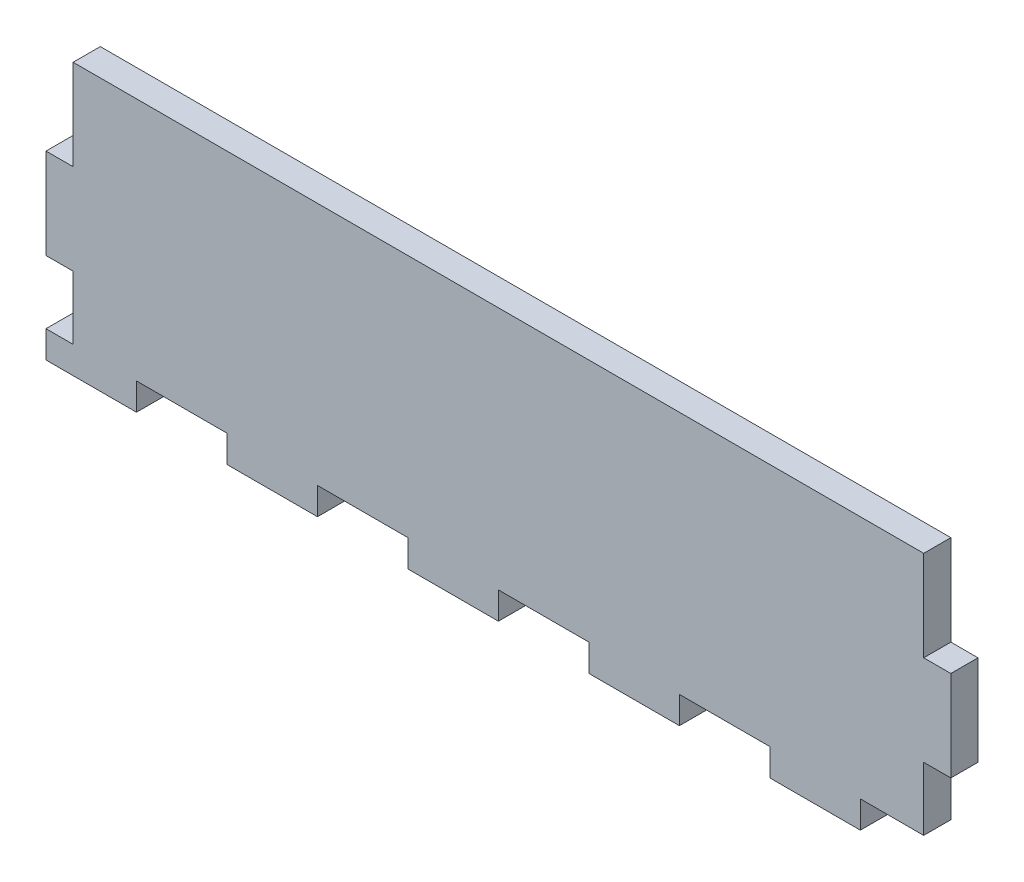
ISO-10303-21;
HEADER;
FILE_DESCRIPTION(('STEP AP214'),'2;1');
FILE_NAME('part.step','',(''),(''),'','','');
FILE_SCHEMA(('AUTOMOTIVE_DESIGN { 1 0 10303 214 1 1 1 1 }'));
ENDSEC;
DATA;
#1=APPLICATION_CONTEXT('core data for automotive mechanical design processes');
#2=APPLICATION_PROTOCOL_DEFINITION('international standard','automotive_design',2000,#1);
#3=PRODUCT_CONTEXT('',#1,'mechanical');
#4=PRODUCT('Part','Part','',(#3));
#5=PRODUCT_RELATED_PRODUCT_CATEGORY('part','',(#4));
#6=PRODUCT_DEFINITION_FORMATION('','',#4);
#7=PRODUCT_DEFINITION_CONTEXT('part definition',#1,'design');
#8=PRODUCT_DEFINITION('design','',#6,#7);
#9=PRODUCT_DEFINITION_SHAPE('','',#8);
#10=(LENGTH_UNIT() NAMED_UNIT(*) SI_UNIT(.MILLI.,.METRE.));
#11=(NAMED_UNIT(*) PLANE_ANGLE_UNIT() SI_UNIT($,.RADIAN.));
#12=(NAMED_UNIT(*) SI_UNIT($,.STERADIAN.) SOLID_ANGLE_UNIT());
#13=UNCERTAINTY_MEASURE_WITH_UNIT(LENGTH_MEASURE(1.E-05),#10,'distance_accuracy_value','');
#14=(GEOMETRIC_REPRESENTATION_CONTEXT(3) GLOBAL_UNCERTAINTY_ASSIGNED_CONTEXT((#13)) GLOBAL_UNIT_ASSIGNED_CONTEXT((#10,
#11,#12)) REPRESENTATION_CONTEXT('',''));
#15=CARTESIAN_POINT('',(0.,0.,0.));
#16=DIRECTION('',(0.,0.,1.));
#17=DIRECTION('',(1.,0.,0.));
#18=AXIS2_PLACEMENT_3D('',#15,#16,#17);
#19=CARTESIAN_POINT('',(-220.231213872832,146.098265895954,6.));
#20=DIRECTION('',(1.,0.,0.));
#21=DIRECTION('',(0.,0.,-1.));
#22=AXIS2_PLACEMENT_3D('',#19,#20,#21);
#23=PLANE('',#22);
#24=DIRECTION('',(0.,-1.,0.));
#25=VECTOR('',#24,1.);
#26=CARTESIAN_POINT('',(-220.231213872832,146.098265895954,0.));
#27=LINE('',#26,#25);
#28=CARTESIAN_POINT('',(-220.231213872832,126.098265895954,0.));
#29=VERTEX_POINT('',#28);
#30=CARTESIAN_POINT('',(-220.231213872832,106.098265895954,0.));
#31=VERTEX_POINT('',#30);
#32=EDGE_CURVE('E296',#29,#31,#27,.T.);
#33=ORIENTED_EDGE('',*,*,#32,.T.);
#34=DIRECTION('',(0.,0.,-1.));
#35=VECTOR('',#34,1.);
#36=CARTESIAN_POINT('',(-220.231213872832,106.098265895954,10.));
#37=LINE('',#36,#35);
#38=CARTESIAN_POINT('',(-220.231213872832,106.098265895954,6.));
#39=VERTEX_POINT('',#38);
#40=EDGE_CURVE('E543',#39,#31,#37,.T.);
#41=ORIENTED_EDGE('',*,*,#40,.F.);
#42=DIRECTION('',(0.,-1.,0.));
#43=VECTOR('',#42,1.);
#44=CARTESIAN_POINT('',(-220.231213872832,146.098265895954,6.));
#45=LINE('',#44,#43);
#46=CARTESIAN_POINT('',(-220.231213872832,126.098265895954,6.));
#47=VERTEX_POINT('',#46);
#48=EDGE_CURVE('E283',#47,#39,#45,.T.);
#49=ORIENTED_EDGE('',*,*,#48,.F.);
#50=DIRECTION('',(0.,0.,-1.));
#51=VECTOR('',#50,1.);
#52=CARTESIAN_POINT('',(-220.231213872832,126.098265895954,10.));
#53=LINE('',#52,#51);
#54=EDGE_CURVE('E577',#47,#29,#53,.T.);
#55=ORIENTED_EDGE('',*,*,#54,.T.);
#56=EDGE_LOOP('',(#33,#41,#49,#55));
#57=FACE_BOUND('',#56,.T.);
#58=ADVANCED_FACE('F40',(#57),#23,.F.);
#59=CARTESIAN_POINT('',(-220.231213872832,86.0982658959538,6.));
#60=DIRECTION('',(0.,1.,0.));
#61=DIRECTION('',(0.,0.,1.));
#62=AXIS2_PLACEMENT_3D('',#59,#60,#61);
#63=PLANE('',#62);
#64=DIRECTION('',(1.,0.,0.));
#65=VECTOR('',#64,1.);
#66=CARTESIAN_POINT('',(-220.231213872832,86.0982658959538,6.));
#67=LINE('',#66,#65);
#68=CARTESIAN_POINT('',(-60.2312138728323,86.0982658959538,6.));
#69=VERTEX_POINT('',#68);
#70=CARTESIAN_POINT('',(-40.2312138728323,86.0982658959538,6.));
#71=VERTEX_POINT('',#70);
#72=EDGE_CURVE('E286',#69,#71,#67,.T.);
#73=ORIENTED_EDGE('',*,*,#72,.F.);
#74=DIRECTION('',(0.,0.,-1.));
#75=VECTOR('',#74,1.);
#76=CARTESIAN_POINT('',(-60.2312138728323,86.0982658959538,10.));
#77=LINE('',#76,#75);
#78=CARTESIAN_POINT('',(-60.2312138728323,86.0982658959538,0.));
#79=VERTEX_POINT('',#78);
#80=EDGE_CURVE('E374',#69,#79,#77,.T.);
#81=ORIENTED_EDGE('',*,*,#80,.T.);
#82=DIRECTION('',(1.,0.,0.));
#83=VECTOR('',#82,1.);
#84=CARTESIAN_POINT('',(-220.231213872832,86.0982658959538,0.));
#85=LINE('',#84,#83);
#86=CARTESIAN_POINT('',(-40.2312138728323,86.0982658959538,0.));
#87=VERTEX_POINT('',#86);
#88=EDGE_CURVE('E299',#79,#87,#85,.T.);
#89=ORIENTED_EDGE('',*,*,#88,.T.);
#90=DIRECTION('',(0.,0.,-1.));
#91=VECTOR('',#90,1.);
#92=CARTESIAN_POINT('',(-40.2312138728323,86.0982658959538,10.));
#93=LINE('',#92,#91);
#94=EDGE_CURVE('E267',#71,#87,#93,.T.);
#95=ORIENTED_EDGE('',*,*,#94,.F.);
#96=EDGE_LOOP('',(#73,#81,#89,#95));
#97=FACE_BOUND('',#96,.T.);
#98=ADVANCED_FACE('F459',(#97),#63,.F.);
#99=CARTESIAN_POINT('',(-100.231213872832,86.0982658959538,0.));
#100=VERTEX_POINT('',#99);
#101=CARTESIAN_POINT('',(-80.2312138728323,86.0982658959538,0.));
#102=VERTEX_POINT('',#101);
#103=EDGE_CURVE('E404',#100,#102,#85,.T.);
#104=ORIENTED_EDGE('',*,*,#103,.T.);
#105=DIRECTION('',(0.,0.,-1.));
#106=VECTOR('',#105,1.);
#107=CARTESIAN_POINT('',(-80.2312138728323,86.0982658959538,10.));
#108=LINE('',#107,#106);
#109=CARTESIAN_POINT('',(-80.2312138728323,86.0982658959538,6.));
#110=VERTEX_POINT('',#109);
#111=EDGE_CURVE('E397',#110,#102,#108,.T.);
#112=ORIENTED_EDGE('',*,*,#111,.F.);
#113=CARTESIAN_POINT('',(-100.231213872832,86.0982658959538,6.));
#114=VERTEX_POINT('',#113);
#115=EDGE_CURVE('E392',#114,#110,#67,.T.);
#116=ORIENTED_EDGE('',*,*,#115,.F.);
#117=DIRECTION('',(0.,0.,-1.));
#118=VECTOR('',#117,1.);
#119=CARTESIAN_POINT('',(-100.231213872832,86.0982658959538,10.));
#120=LINE('',#119,#118);
#121=EDGE_CURVE('E418',#114,#100,#120,.T.);
#122=ORIENTED_EDGE('',*,*,#121,.T.);
#123=EDGE_LOOP('',(#104,#112,#116,#122));
#124=FACE_BOUND('',#123,.T.);
#125=ADVANCED_FACE('F401',(#124),#63,.F.);
#126=CARTESIAN_POINT('',(-140.231213872832,86.0982658959538,0.));
#127=VERTEX_POINT('',#126);
#128=CARTESIAN_POINT('',(-120.231213872832,86.0982658959538,0.));
#129=VERTEX_POINT('',#128);
#130=EDGE_CURVE('E446',#127,#129,#85,.T.);
#131=ORIENTED_EDGE('',*,*,#130,.T.);
#132=DIRECTION('',(0.,0.,-1.));
#133=VECTOR('',#132,1.);
#134=CARTESIAN_POINT('',(-120.231213872832,86.0982658959538,10.));
#135=LINE('',#134,#133);
#136=CARTESIAN_POINT('',(-120.231213872832,86.0982658959538,6.));
#137=VERTEX_POINT('',#136);
#138=EDGE_CURVE('E424',#137,#129,#135,.T.);
#139=ORIENTED_EDGE('',*,*,#138,.F.);
#140=CARTESIAN_POINT('',(-140.231213872832,86.0982658959538,6.));
#141=VERTEX_POINT('',#140);
#142=EDGE_CURVE('E448',#141,#137,#67,.T.);
#143=ORIENTED_EDGE('',*,*,#142,.F.);
#144=DIRECTION('',(0.,0.,-1.));
#145=VECTOR('',#144,1.);
#146=CARTESIAN_POINT('',(-140.231213872832,86.0982658959538,10.));
#147=LINE('',#146,#145);
#148=EDGE_CURVE('E434',#141,#127,#147,.T.);
#149=ORIENTED_EDGE('',*,*,#148,.T.);
#150=EDGE_LOOP('',(#131,#139,#143,#149));
#151=FACE_BOUND('',#150,.T.);
#152=ADVANCED_FACE('F444',(#151),#63,.F.);
#153=CARTESIAN_POINT('',(-180.231213872832,86.0982658959538,0.));
#154=VERTEX_POINT('',#153);
#155=CARTESIAN_POINT('',(-160.231213872832,86.0982658959538,0.));
#156=VERTEX_POINT('',#155);
#157=EDGE_CURVE('E304',#154,#156,#85,.T.);
#158=ORIENTED_EDGE('',*,*,#157,.T.);
#159=DIRECTION('',(0.,0.,-1.));
#160=VECTOR('',#159,1.);
#161=CARTESIAN_POINT('',(-160.231213872832,86.0982658959538,10.));
#162=LINE('',#161,#160);
#163=CARTESIAN_POINT('',(-160.231213872832,86.0982658959538,6.));
#164=VERTEX_POINT('',#163);
#165=EDGE_CURVE('E438',#164,#156,#162,.T.);
#166=ORIENTED_EDGE('',*,*,#165,.F.);
#167=CARTESIAN_POINT('',(-180.231213872832,86.0982658959538,6.));
#168=VERTEX_POINT('',#167);
#169=EDGE_CURVE('E292',#168,#164,#67,.T.);
#170=ORIENTED_EDGE('',*,*,#169,.F.);
#171=DIRECTION('',(0.,0.,-1.));
#172=VECTOR('',#171,1.);
#173=CARTESIAN_POINT('',(-180.231213872832,86.0982658959538,10.));
#174=LINE('',#173,#172);
#175=EDGE_CURVE('E331',#168,#154,#174,.T.);
#176=ORIENTED_EDGE('',*,*,#175,.T.);
#177=EDGE_LOOP('',(#158,#166,#170,#176));
#178=FACE_BOUND('',#177,.T.);
#179=ADVANCED_FACE('F472',(#178),#63,.F.);
#180=CARTESIAN_POINT('',(-220.231213872832,92.0982658959538,6.));
#181=VERTEX_POINT('',#180);
#182=CARTESIAN_POINT('',(-220.231213872832,86.0982658959538,6.));
#183=VERTEX_POINT('',#182);
#184=EDGE_CURVE('E287',#181,#183,#45,.T.);
#185=ORIENTED_EDGE('',*,*,#184,.F.);
#186=DIRECTION('',(0.,0.,-1.));
#187=VECTOR('',#186,1.);
#188=CARTESIAN_POINT('',(-220.231213872832,92.0982658959538,10.));
#189=LINE('',#188,#187);
#190=CARTESIAN_POINT('',(-220.231213872832,92.0982658959538,0.));
#191=VERTEX_POINT('',#190);
#192=EDGE_CURVE('E318',#181,#191,#189,.T.);
#193=ORIENTED_EDGE('',*,*,#192,.T.);
#194=CARTESIAN_POINT('',(-220.231213872832,86.0982658959538,0.));
#195=VERTEX_POINT('',#194);
#196=EDGE_CURVE('E282',#191,#195,#27,.T.);
#197=ORIENTED_EDGE('',*,*,#196,.T.);
#198=DIRECTION('',(0.,0.,-1.));
#199=VECTOR('',#198,1.);
#200=CARTESIAN_POINT('',(-220.231213872832,86.0982658959538,6.));
#201=LINE('',#200,#199);
#202=EDGE_CURVE('E48',#183,#195,#201,.T.);
#203=ORIENTED_EDGE('',*,*,#202,.F.);
#204=EDGE_LOOP('',(#185,#193,#197,#203));
#205=FACE_BOUND('',#204,.T.);
#206=ADVANCED_FACE('F42',(#205),#23,.F.);
#207=CARTESIAN_POINT('',(-200.231213872832,86.0982658959538,0.));
#208=VERTEX_POINT('',#207);
#209=EDGE_CURVE('E300',#195,#208,#85,.T.);
#210=ORIENTED_EDGE('',*,*,#209,.T.);
#211=DIRECTION('',(0.,0.,-1.));
#212=VECTOR('',#211,1.);
#213=CARTESIAN_POINT('',(-200.231213872832,86.0982658959538,10.));
#214=LINE('',#213,#212);
#215=CARTESIAN_POINT('',(-200.231213872832,86.0982658959538,6.));
#216=VERTEX_POINT('',#215);
#217=EDGE_CURVE('E342',#216,#208,#214,.T.);
#218=ORIENTED_EDGE('',*,*,#217,.F.);
#219=EDGE_CURVE('E288',#183,#216,#67,.T.);
#220=ORIENTED_EDGE('',*,*,#219,.F.);
#221=ORIENTED_EDGE('',*,*,#202,.T.);
#222=EDGE_LOOP('',(#210,#218,#220,#221));
#223=FACE_BOUND('',#222,.T.);
#224=ADVANCED_FACE('F311',(#223),#63,.F.);
#225=CARTESIAN_POINT('',(-20.2312138728323,146.098265895954,6.));
#226=DIRECTION('',(-1.,0.,0.));
#227=DIRECTION('',(0.,0.,1.));
#228=AXIS2_PLACEMENT_3D('',#225,#226,#227);
#229=PLANE('',#228);
#230=DIRECTION('',(0.,1.,0.));
#231=VECTOR('',#230,1.);
#232=CARTESIAN_POINT('',(-20.2312138728323,146.098265895954,6.));
#233=LINE('',#232,#231);
#234=CARTESIAN_POINT('',(-20.2312138728323,106.098265895954,6.));
#235=VERTEX_POINT('',#234);
#236=CARTESIAN_POINT('',(-20.2312138728323,126.098265895954,6.));
#237=VERTEX_POINT('',#236);
#238=EDGE_CURVE('E291',#235,#237,#233,.T.);
#239=ORIENTED_EDGE('',*,*,#238,.F.);
#240=DIRECTION('',(0.,0.,-1.));
#241=VECTOR('',#240,1.);
#242=CARTESIAN_POINT('',(-20.2312138728323,106.098265895954,10.));
#243=LINE('',#242,#241);
#244=CARTESIAN_POINT('',(-20.2312138728323,106.098265895954,0.));
#245=VERTEX_POINT('',#244);
#246=EDGE_CURVE('E780',#235,#245,#243,.T.);
#247=ORIENTED_EDGE('',*,*,#246,.T.);
#248=DIRECTION('',(0.,1.,0.));
#249=VECTOR('',#248,1.);
#250=CARTESIAN_POINT('',(-20.2312138728323,146.098265895954,0.));
#251=LINE('',#250,#249);
#252=CARTESIAN_POINT('',(-20.2312138728323,126.098265895954,0.));
#253=VERTEX_POINT('',#252);
#254=EDGE_CURVE('E303',#245,#253,#251,.T.);
#255=ORIENTED_EDGE('',*,*,#254,.T.);
#256=DIRECTION('',(0.,0.,-1.));
#257=VECTOR('',#256,1.);
#258=CARTESIAN_POINT('',(-20.2312138728323,126.098265895954,10.));
#259=LINE('',#258,#257);
#260=EDGE_CURVE('E555',#237,#253,#259,.T.);
#261=ORIENTED_EDGE('',*,*,#260,.F.);
#262=EDGE_LOOP('',(#239,#247,#255,#261));
#263=FACE_BOUND('',#262,.T.);
#264=ADVANCED_FACE('F504',(#263),#229,.F.);
#265=CARTESIAN_POINT('',(-220.231213872832,146.098265895954,6.));
#266=DIRECTION('',(0.,-1.,0.));
#267=DIRECTION('',(0.,0.,-1.));
#268=AXIS2_PLACEMENT_3D('',#265,#266,#267);
#269=PLANE('',#268);
#270=DIRECTION('',(-1.,0.,0.));
#271=VECTOR('',#270,1.);
#272=CARTESIAN_POINT('',(-220.231213872832,146.098265895954,6.));
#273=LINE('',#272,#271);
#274=CARTESIAN_POINT('',(-26.2312138728323,146.098265895954,6.));
#275=VERTEX_POINT('',#274);
#276=CARTESIAN_POINT('',(-214.231213872832,146.098265895954,6.));
#277=VERTEX_POINT('',#276);
#278=EDGE_CURVE('E294',#275,#277,#273,.T.);
#279=ORIENTED_EDGE('',*,*,#278,.F.);
#280=DIRECTION('',(0.,0.,-1.));
#281=VECTOR('',#280,1.);
#282=CARTESIAN_POINT('',(-26.2312138728323,146.098265895954,10.));
#283=LINE('',#282,#281);
#284=CARTESIAN_POINT('',(-26.2312138728323,146.098265895954,0.));
#285=VERTEX_POINT('',#284);
#286=EDGE_CURVE('E556',#275,#285,#283,.T.);
#287=ORIENTED_EDGE('',*,*,#286,.T.);
#288=DIRECTION('',(-1.,0.,0.));
#289=VECTOR('',#288,1.);
#290=CARTESIAN_POINT('',(-220.231213872832,146.098265895954,0.));
#291=LINE('',#290,#289);
#292=CARTESIAN_POINT('',(-214.231213872832,146.098265895954,0.));
#293=VERTEX_POINT('',#292);
#294=EDGE_CURVE('E306',#285,#293,#291,.T.);
#295=ORIENTED_EDGE('',*,*,#294,.T.);
#296=DIRECTION('',(0.,0.,-1.));
#297=VECTOR('',#296,1.);
#298=CARTESIAN_POINT('',(-214.231213872832,146.098265895954,10.));
#299=LINE('',#298,#297);
#300=EDGE_CURVE('E573',#277,#293,#299,.T.);
#301=ORIENTED_EDGE('',*,*,#300,.F.);
#302=EDGE_LOOP('',(#279,#287,#295,#301));
#303=FACE_BOUND('',#302,.T.);
#304=ADVANCED_FACE('F511',(#303),#269,.F.);
#305=CARTESIAN_POINT('',(0.,0.,6.));
#306=DIRECTION('',(0.,0.,1.));
#307=DIRECTION('',(1.,0.,0.));
#308=AXIS2_PLACEMENT_3D('',#305,#306,#307);
#309=PLANE('',#308);
#310=DIRECTION('',(-1.,0.,0.));
#311=VECTOR('',#310,1.);
#312=CARTESIAN_POINT('',(0.,106.098265895954,6.));
#313=LINE('',#312,#311);
#314=CARTESIAN_POINT('',(-26.2312138728323,106.098265895954,6.));
#315=VERTEX_POINT('',#314);
#316=EDGE_CURVE('E777',#235,#315,#313,.T.);
#317=ORIENTED_EDGE('',*,*,#316,.F.);
#318=ORIENTED_EDGE('',*,*,#238,.T.);
#319=DIRECTION('',(1.,0.,0.));
#320=VECTOR('',#319,1.);
#321=CARTESIAN_POINT('',(0.,126.098265895954,6.));
#322=LINE('',#321,#320);
#323=CARTESIAN_POINT('',(-26.2312138728323,126.098265895954,6.));
#324=VERTEX_POINT('',#323);
#325=EDGE_CURVE('E559',#324,#237,#322,.T.);
#326=ORIENTED_EDGE('',*,*,#325,.F.);
#327=DIRECTION('',(0.,-1.,0.));
#328=VECTOR('',#327,1.);
#329=CARTESIAN_POINT('',(-26.2312138728323,0.,6.));
#330=LINE('',#329,#328);
#331=EDGE_CURVE('E566',#275,#324,#330,.T.);
#332=ORIENTED_EDGE('',*,*,#331,.F.);
#333=ORIENTED_EDGE('',*,*,#278,.T.);
#334=DIRECTION('',(0.,1.,0.));
#335=VECTOR('',#334,1.);
#336=CARTESIAN_POINT('',(-214.231213872832,0.,6.));
#337=LINE('',#336,#335);
#338=CARTESIAN_POINT('',(-214.231213872832,126.098265895954,6.));
#339=VERTEX_POINT('',#338);
#340=EDGE_CURVE('E333',#339,#277,#337,.T.);
#341=ORIENTED_EDGE('',*,*,#340,.F.);
#342=DIRECTION('',(1.,0.,0.));
#343=VECTOR('',#342,1.);
#344=CARTESIAN_POINT('',(0.,126.098265895954,6.));
#345=LINE('',#344,#343);
#346=EDGE_CURVE('E576',#47,#339,#345,.T.);
#347=ORIENTED_EDGE('',*,*,#346,.F.);
#348=ORIENTED_EDGE('',*,*,#48,.T.);
#349=DIRECTION('',(-1.,0.,0.));
#350=VECTOR('',#349,1.);
#351=CARTESIAN_POINT('',(0.,106.098265895954,6.));
#352=LINE('',#351,#350);
#353=CARTESIAN_POINT('',(-214.231213872832,106.098265895954,6.));
#354=VERTEX_POINT('',#353);
#355=EDGE_CURVE('E539',#354,#39,#352,.T.);
#356=ORIENTED_EDGE('',*,*,#355,.F.);
#357=DIRECTION('',(0.,1.,0.));
#358=VECTOR('',#357,1.);
#359=CARTESIAN_POINT('',(-214.231213872832,0.,6.));
#360=LINE('',#359,#358);
#361=CARTESIAN_POINT('',(-214.231213872832,92.0982658959538,6.));
#362=VERTEX_POINT('',#361);
#363=EDGE_CURVE('E537',#362,#354,#360,.T.);
#364=ORIENTED_EDGE('',*,*,#363,.F.);
#365=DIRECTION('',(1.,0.,0.));
#366=VECTOR('',#365,1.);
#367=CARTESIAN_POINT('',(0.,92.0982658959538,6.));
#368=LINE('',#367,#366);
#369=EDGE_CURVE('E535',#181,#362,#368,.T.);
#370=ORIENTED_EDGE('',*,*,#369,.F.);
#371=ORIENTED_EDGE('',*,*,#184,.T.);
#372=ORIENTED_EDGE('',*,*,#219,.T.);
#373=DIRECTION('',(0.,-1.,0.));
#374=VECTOR('',#373,1.);
#375=CARTESIAN_POINT('',(-200.231213872832,0.,6.));
#376=LINE('',#375,#374);
#377=CARTESIAN_POINT('',(-200.231213872832,92.0982658959538,6.));
#378=VERTEX_POINT('',#377);
#379=EDGE_CURVE('E346',#378,#216,#376,.T.);
#380=ORIENTED_EDGE('',*,*,#379,.F.);
#381=DIRECTION('',(-1.,0.,0.));
#382=VECTOR('',#381,1.);
#383=CARTESIAN_POINT('',(0.,92.0982658959538,6.));
#384=LINE('',#383,#382);
#385=CARTESIAN_POINT('',(-180.231213872832,92.0982658959538,6.));
#386=VERTEX_POINT('',#385);
#387=EDGE_CURVE('E348',#386,#378,#384,.T.);
#388=ORIENTED_EDGE('',*,*,#387,.F.);
#389=DIRECTION('',(0.,1.,0.));
#390=VECTOR('',#389,1.);
#391=CARTESIAN_POINT('',(-180.231213872832,0.,6.));
#392=LINE('',#391,#390);
#393=EDGE_CURVE('E351',#168,#386,#392,.T.);
#394=ORIENTED_EDGE('',*,*,#393,.F.);
#395=ORIENTED_EDGE('',*,*,#169,.T.);
#396=DIRECTION('',(0.,-1.,0.));
#397=VECTOR('',#396,1.);
#398=CARTESIAN_POINT('',(-160.231213872832,0.,6.));
#399=LINE('',#398,#397);
#400=CARTESIAN_POINT('',(-160.231213872832,92.0982658959538,6.));
#401=VERTEX_POINT('',#400);
#402=EDGE_CURVE('E353',#401,#164,#399,.T.);
#403=ORIENTED_EDGE('',*,*,#402,.F.);
#404=DIRECTION('',(-1.,0.,0.));
#405=VECTOR('',#404,1.);
#406=CARTESIAN_POINT('',(0.,92.0982658959538,6.));
#407=LINE('',#406,#405);
#408=CARTESIAN_POINT('',(-140.231213872832,92.0982658959538,6.));
#409=VERTEX_POINT('',#408);
#410=EDGE_CURVE('E355',#409,#401,#407,.T.);
#411=ORIENTED_EDGE('',*,*,#410,.F.);
#412=DIRECTION('',(0.,1.,0.));
#413=VECTOR('',#412,1.);
#414=CARTESIAN_POINT('',(-140.231213872832,0.,6.));
#415=LINE('',#414,#413);
#416=EDGE_CURVE('E357',#141,#409,#415,.T.);
#417=ORIENTED_EDGE('',*,*,#416,.F.);
#418=ORIENTED_EDGE('',*,*,#142,.T.);
#419=DIRECTION('',(0.,-1.,0.));
#420=VECTOR('',#419,1.);
#421=CARTESIAN_POINT('',(-120.231213872832,0.,6.));
#422=LINE('',#421,#420);
#423=CARTESIAN_POINT('',(-120.231213872832,92.0982658959538,6.));
#424=VERTEX_POINT('',#423);
#425=EDGE_CURVE('E359',#424,#137,#422,.T.);
#426=ORIENTED_EDGE('',*,*,#425,.F.);
#427=DIRECTION('',(-1.,0.,0.));
#428=VECTOR('',#427,1.);
#429=CARTESIAN_POINT('',(0.,92.0982658959538,6.));
#430=LINE('',#429,#428);
#431=CARTESIAN_POINT('',(-100.231213872832,92.0982658959538,6.));
#432=VERTEX_POINT('',#431);
#433=EDGE_CURVE('E361',#432,#424,#430,.T.);
#434=ORIENTED_EDGE('',*,*,#433,.F.);
#435=DIRECTION('',(0.,1.,0.));
#436=VECTOR('',#435,1.);
#437=CARTESIAN_POINT('',(-100.231213872832,0.,6.));
#438=LINE('',#437,#436);
#439=EDGE_CURVE('E363',#114,#432,#438,.T.);
#440=ORIENTED_EDGE('',*,*,#439,.F.);
#441=ORIENTED_EDGE('',*,*,#115,.T.);
#442=DIRECTION('',(0.,-1.,0.));
#443=VECTOR('',#442,1.);
#444=CARTESIAN_POINT('',(-80.2312138728323,0.,6.));
#445=LINE('',#444,#443);
#446=CARTESIAN_POINT('',(-80.2312138728323,92.0982658959538,6.));
#447=VERTEX_POINT('',#446);
#448=EDGE_CURVE('E365',#447,#110,#445,.T.);
#449=ORIENTED_EDGE('',*,*,#448,.F.);
#450=DIRECTION('',(-1.,0.,0.));
#451=VECTOR('',#450,1.);
#452=CARTESIAN_POINT('',(0.,92.0982658959538,6.));
#453=LINE('',#452,#451);
#454=CARTESIAN_POINT('',(-60.2312138728323,92.0982658959538,6.));
#455=VERTEX_POINT('',#454);
#456=EDGE_CURVE('E367',#455,#447,#453,.T.);
#457=ORIENTED_EDGE('',*,*,#456,.F.);
#458=DIRECTION('',(0.,1.,0.));
#459=VECTOR('',#458,1.);
#460=CARTESIAN_POINT('',(-60.2312138728323,0.,6.));
#461=LINE('',#460,#459);
#462=EDGE_CURVE('E272',#69,#455,#461,.T.);
#463=ORIENTED_EDGE('',*,*,#462,.F.);
#464=ORIENTED_EDGE('',*,*,#72,.T.);
#465=DIRECTION('',(0.,-1.,0.));
#466=VECTOR('',#465,1.);
#467=CARTESIAN_POINT('',(-40.2312138728323,0.,6.));
#468=LINE('',#467,#466);
#469=CARTESIAN_POINT('',(-40.2312138728323,92.0982658959538,6.));
#470=VERTEX_POINT('',#469);
#471=EDGE_CURVE('E276',#470,#71,#468,.T.);
#472=ORIENTED_EDGE('',*,*,#471,.F.);
#473=DIRECTION('',(-1.,0.,0.));
#474=VECTOR('',#473,1.);
#475=CARTESIAN_POINT('',(0.,92.0982658959538,6.));
#476=LINE('',#475,#474);
#477=CARTESIAN_POINT('',(-26.2312138728323,92.0982658959538,6.));
#478=VERTEX_POINT('',#477);
#479=EDGE_CURVE('E280',#478,#470,#476,.T.);
#480=ORIENTED_EDGE('',*,*,#479,.F.);
#481=DIRECTION('',(0.,-1.,0.));
#482=VECTOR('',#481,1.);
#483=CARTESIAN_POINT('',(-26.2312138728323,0.,6.));
#484=LINE('',#483,#482);
#485=EDGE_CURVE('E55',#315,#478,#484,.T.);
#486=ORIENTED_EDGE('',*,*,#485,.F.);
#487=EDGE_LOOP('',(#317,#318,#326,#332,#333,#341,#347,#348,#356,#364,#370,#371,#372,#380,#388,
#394,#395,#403,#411,#417,#418,#426,#434,#440,#441,#449,#457,#463,#464,#472,#480,#486));
#488=FACE_BOUND('',#487,.T.);
#489=ADVANCED_FACE('F388',(#488),#309,.T.);
#490=CARTESIAN_POINT('',(0.,0.,0.));
#491=DIRECTION('',(0.,0.,1.));
#492=DIRECTION('',(1.,0.,0.));
#493=AXIS2_PLACEMENT_3D('',#490,#491,#492);
#494=PLANE('',#493);
#495=ORIENTED_EDGE('',*,*,#254,.F.);
#496=DIRECTION('',(1.,0.,0.));
#497=VECTOR('',#496,1.);
#498=CARTESIAN_POINT('',(-20.2312138728323,106.098265895954,0.));
#499=LINE('',#498,#497);
#500=CARTESIAN_POINT('',(-26.2312138728323,106.098265895954,0.));
#501=VERTEX_POINT('',#500);
#502=EDGE_CURVE('E261',#501,#245,#499,.T.);
#503=ORIENTED_EDGE('',*,*,#502,.F.);
#504=DIRECTION('',(0.,1.,0.));
#505=VECTOR('',#504,1.);
#506=CARTESIAN_POINT('',(-26.2312138728323,106.098265895954,0.));
#507=LINE('',#506,#505);
#508=CARTESIAN_POINT('',(-26.2312138728323,92.0982658959538,0.));
#509=VERTEX_POINT('',#508);
#510=EDGE_CURVE('E250',#509,#501,#507,.T.);
#511=ORIENTED_EDGE('',*,*,#510,.F.);
#512=DIRECTION('',(1.,0.,0.));
#513=VECTOR('',#512,1.);
#514=CARTESIAN_POINT('',(-20.2312138728323,92.0982658959538,0.));
#515=LINE('',#514,#513);
#516=CARTESIAN_POINT('',(-40.2312138728323,92.0982658959538,0.));
#517=VERTEX_POINT('',#516);
#518=EDGE_CURVE('E260',#517,#509,#515,.T.);
#519=ORIENTED_EDGE('',*,*,#518,.F.);
#520=DIRECTION('',(0.,1.,0.));
#521=VECTOR('',#520,1.);
#522=CARTESIAN_POINT('',(-40.2312138728323,86.0982658959538,0.));
#523=LINE('',#522,#521);
#524=EDGE_CURVE('E268',#87,#517,#523,.T.);
#525=ORIENTED_EDGE('',*,*,#524,.F.);
#526=ORIENTED_EDGE('',*,*,#88,.F.);
#527=DIRECTION('',(0.,-1.,0.));
#528=VECTOR('',#527,1.);
#529=CARTESIAN_POINT('',(-60.2312138728323,86.0982658959538,0.));
#530=LINE('',#529,#528);
#531=CARTESIAN_POINT('',(-60.2312138728323,92.0982658959538,0.));
#532=VERTEX_POINT('',#531);
#533=EDGE_CURVE('E421',#532,#79,#530,.T.);
#534=ORIENTED_EDGE('',*,*,#533,.F.);
#535=DIRECTION('',(1.,0.,0.));
#536=VECTOR('',#535,1.);
#537=CARTESIAN_POINT('',(-60.2312138728323,92.0982658959538,0.));
#538=LINE('',#537,#536);
#539=CARTESIAN_POINT('',(-80.2312138728323,92.0982658959538,0.));
#540=VERTEX_POINT('',#539);
#541=EDGE_CURVE('E382',#540,#532,#538,.T.);
#542=ORIENTED_EDGE('',*,*,#541,.F.);
#543=DIRECTION('',(0.,1.,0.));
#544=VECTOR('',#543,1.);
#545=CARTESIAN_POINT('',(-80.2312138728323,86.0982658959538,0.));
#546=LINE('',#545,#544);
#547=EDGE_CURVE('E586',#102,#540,#546,.T.);
#548=ORIENTED_EDGE('',*,*,#547,.F.);
#549=ORIENTED_EDGE('',*,*,#103,.F.);
#550=DIRECTION('',(0.,-1.,0.));
#551=VECTOR('',#550,1.);
#552=CARTESIAN_POINT('',(-100.231213872832,86.0982658959538,0.));
#553=LINE('',#552,#551);
#554=CARTESIAN_POINT('',(-100.231213872832,92.0982658959538,0.));
#555=VERTEX_POINT('',#554);
#556=EDGE_CURVE('E409',#555,#100,#553,.T.);
#557=ORIENTED_EDGE('',*,*,#556,.F.);
#558=DIRECTION('',(1.,0.,0.));
#559=VECTOR('',#558,1.);
#560=CARTESIAN_POINT('',(-100.231213872832,92.0982658959538,0.));
#561=LINE('',#560,#559);
#562=CARTESIAN_POINT('',(-120.231213872832,92.0982658959538,0.));
#563=VERTEX_POINT('',#562);
#564=EDGE_CURVE('E415',#563,#555,#561,.T.);
#565=ORIENTED_EDGE('',*,*,#564,.F.);
#566=DIRECTION('',(0.,1.,0.));
#567=VECTOR('',#566,1.);
#568=CARTESIAN_POINT('',(-120.231213872832,86.0982658959538,0.));
#569=LINE('',#568,#567);
#570=EDGE_CURVE('E411',#129,#563,#569,.T.);
#571=ORIENTED_EDGE('',*,*,#570,.F.);
#572=ORIENTED_EDGE('',*,*,#130,.F.);
#573=DIRECTION('',(0.,-1.,0.));
#574=VECTOR('',#573,1.);
#575=CARTESIAN_POINT('',(-140.231213872832,86.0982658959538,0.));
#576=LINE('',#575,#574);
#577=CARTESIAN_POINT('',(-140.231213872832,92.0982658959538,0.));
#578=VERTEX_POINT('',#577);
#579=EDGE_CURVE('E339',#578,#127,#576,.T.);
#580=ORIENTED_EDGE('',*,*,#579,.F.);
#581=DIRECTION('',(1.,0.,0.));
#582=VECTOR('',#581,1.);
#583=CARTESIAN_POINT('',(-140.231213872832,92.0982658959538,0.));
#584=LINE('',#583,#582);
#585=CARTESIAN_POINT('',(-160.231213872832,92.0982658959538,0.));
#586=VERTEX_POINT('',#585);
#587=EDGE_CURVE('E431',#586,#578,#584,.T.);
#588=ORIENTED_EDGE('',*,*,#587,.F.);
#589=DIRECTION('',(0.,1.,0.));
#590=VECTOR('',#589,1.);
#591=CARTESIAN_POINT('',(-160.231213872832,86.0982658959538,0.));
#592=LINE('',#591,#590);
#593=EDGE_CURVE('E428',#156,#586,#592,.T.);
#594=ORIENTED_EDGE('',*,*,#593,.F.);
#595=ORIENTED_EDGE('',*,*,#157,.F.);
#596=DIRECTION('',(0.,-1.,0.));
#597=VECTOR('',#596,1.);
#598=CARTESIAN_POINT('',(-180.231213872832,86.0982658959538,0.));
#599=LINE('',#598,#597);
#600=CARTESIAN_POINT('',(-180.231213872832,92.0982658959538,0.));
#601=VERTEX_POINT('',#600);
#602=EDGE_CURVE('E329',#601,#154,#599,.T.);
#603=ORIENTED_EDGE('',*,*,#602,.F.);
#604=DIRECTION('',(1.,0.,0.));
#605=VECTOR('',#604,1.);
#606=CARTESIAN_POINT('',(-180.231213872832,92.0982658959538,0.));
#607=LINE('',#606,#605);
#608=CARTESIAN_POINT('',(-200.231213872832,92.0982658959538,0.));
#609=VERTEX_POINT('',#608);
#610=EDGE_CURVE('E326',#609,#601,#607,.T.);
#611=ORIENTED_EDGE('',*,*,#610,.F.);
#612=DIRECTION('',(0.,1.,0.));
#613=VECTOR('',#612,1.);
#614=CARTESIAN_POINT('',(-200.231213872832,86.0982658959538,0.));
#615=LINE('',#614,#613);
#616=EDGE_CURVE('E323',#208,#609,#615,.T.);
#617=ORIENTED_EDGE('',*,*,#616,.F.);
#618=ORIENTED_EDGE('',*,*,#209,.F.);
#619=ORIENTED_EDGE('',*,*,#196,.F.);
#620=DIRECTION('',(-1.,0.,0.));
#621=VECTOR('',#620,1.);
#622=CARTESIAN_POINT('',(-214.231213872832,92.0982658959538,0.));
#623=LINE('',#622,#621);
#624=CARTESIAN_POINT('',(-214.231213872832,92.0982658959538,0.));
#625=VERTEX_POINT('',#624);
#626=EDGE_CURVE('E788',#625,#191,#623,.T.);
#627=ORIENTED_EDGE('',*,*,#626,.F.);
#628=DIRECTION('',(0.,-1.,0.));
#629=VECTOR('',#628,1.);
#630=CARTESIAN_POINT('',(-214.231213872832,106.098265895954,0.));
#631=LINE('',#630,#629);
#632=CARTESIAN_POINT('',(-214.231213872832,106.098265895954,0.));
#633=VERTEX_POINT('',#632);
#634=EDGE_CURVE('E62',#633,#625,#631,.T.);
#635=ORIENTED_EDGE('',*,*,#634,.F.);
#636=DIRECTION('',(1.,0.,0.));
#637=VECTOR('',#636,1.);
#638=CARTESIAN_POINT('',(-214.231213872832,106.098265895954,0.));
#639=LINE('',#638,#637);
#640=EDGE_CURVE('E790',#31,#633,#639,.T.);
#641=ORIENTED_EDGE('',*,*,#640,.F.);
#642=ORIENTED_EDGE('',*,*,#32,.F.);
#643=DIRECTION('',(-1.,0.,0.));
#644=VECTOR('',#643,1.);
#645=CARTESIAN_POINT('',(-214.231213872832,126.098265895954,0.));
#646=LINE('',#645,#644);
#647=CARTESIAN_POINT('',(-214.231213872832,126.098265895954,0.));
#648=VERTEX_POINT('',#647);
#649=EDGE_CURVE('E570',#648,#29,#646,.T.);
#650=ORIENTED_EDGE('',*,*,#649,.F.);
#651=DIRECTION('',(0.,-1.,0.));
#652=VECTOR('',#651,1.);
#653=CARTESIAN_POINT('',(-214.231213872832,126.098265895954,0.));
#654=LINE('',#653,#652);
#655=EDGE_CURVE('E568',#293,#648,#654,.T.);
#656=ORIENTED_EDGE('',*,*,#655,.F.);
#657=ORIENTED_EDGE('',*,*,#294,.F.);
#658=DIRECTION('',(0.,1.,0.));
#659=VECTOR('',#658,1.);
#660=CARTESIAN_POINT('',(-26.2312138728323,146.098265895954,0.));
#661=LINE('',#660,#659);
#662=CARTESIAN_POINT('',(-26.2312138728323,126.098265895954,0.));
#663=VERTEX_POINT('',#662);
#664=EDGE_CURVE('E553',#663,#285,#661,.T.);
#665=ORIENTED_EDGE('',*,*,#664,.F.);
#666=DIRECTION('',(-1.,0.,0.));
#667=VECTOR('',#666,1.);
#668=CARTESIAN_POINT('',(-20.2312138728323,126.098265895954,0.));
#669=LINE('',#668,#667);
#670=EDGE_CURVE('E550',#253,#663,#669,.T.);
#671=ORIENTED_EDGE('',*,*,#670,.F.);
#672=EDGE_LOOP('',(#495,#503,#511,#519,#525,#526,#534,#542,#548,#549,#557,#565,#571,#572,#580,
#588,#594,#595,#603,#611,#617,#618,#619,#627,#635,#641,#642,#650,#656,#657,#665,#671));
#673=FACE_BOUND('',#672,.T.);
#674=ADVANCED_FACE('F258',(#673),#494,.F.);
#675=CARTESIAN_POINT('',(-20.2312138728323,92.0982658959538,10.));
#676=DIRECTION('',(0.,1.,0.));
#677=DIRECTION('',(0.,0.,1.));
#678=AXIS2_PLACEMENT_3D('',#675,#676,#677);
#679=PLANE('',#678);
#680=ORIENTED_EDGE('',*,*,#518,.T.);
#681=DIRECTION('',(0.,0.,1.));
#682=VECTOR('',#681,1.);
#683=CARTESIAN_POINT('',(-26.2312138728323,92.0982658959538,10.));
#684=LINE('',#683,#682);
#685=EDGE_CURVE('E11',#509,#478,#684,.T.);
#686=ORIENTED_EDGE('',*,*,#685,.T.);
#687=ORIENTED_EDGE('',*,*,#479,.T.);
#688=DIRECTION('',(0.,0.,-1.));
#689=VECTOR('',#688,1.);
#690=CARTESIAN_POINT('',(-40.2312138728323,92.0982658959538,10.));
#691=LINE('',#690,#689);
#692=EDGE_CURVE('E265',#470,#517,#691,.T.);
#693=ORIENTED_EDGE('',*,*,#692,.T.);
#694=EDGE_LOOP('',(#680,#686,#687,#693));
#695=FACE_BOUND('',#694,.T.);
#696=ADVANCED_FACE('F263',(#695),#679,.F.);
#697=CARTESIAN_POINT('',(-40.2312138728323,86.0982658959538,10.));
#698=DIRECTION('',(-1.,0.,0.));
#699=DIRECTION('',(0.,0.,1.));
#700=AXIS2_PLACEMENT_3D('',#697,#698,#699);
#701=PLANE('',#700);
#702=ORIENTED_EDGE('',*,*,#471,.T.);
#703=ORIENTED_EDGE('',*,*,#94,.T.);
#704=ORIENTED_EDGE('',*,*,#524,.T.);
#705=ORIENTED_EDGE('',*,*,#692,.F.);
#706=EDGE_LOOP('',(#702,#703,#704,#705));
#707=FACE_BOUND('',#706,.T.);
#708=ADVANCED_FACE('F461',(#707),#701,.F.);
#709=CARTESIAN_POINT('',(-180.231213872832,86.0982658959538,10.));
#710=DIRECTION('',(1.,0.,0.));
#711=DIRECTION('',(0.,0.,-1.));
#712=AXIS2_PLACEMENT_3D('',#709,#710,#711);
#713=PLANE('',#712);
#714=ORIENTED_EDGE('',*,*,#393,.T.);
#715=DIRECTION('',(0.,0.,-1.));
#716=VECTOR('',#715,1.);
#717=CARTESIAN_POINT('',(-180.231213872832,92.0982658959538,10.));
#718=LINE('',#717,#716);
#719=EDGE_CURVE('E337',#386,#601,#718,.T.);
#720=ORIENTED_EDGE('',*,*,#719,.T.);
#721=ORIENTED_EDGE('',*,*,#602,.T.);
#722=ORIENTED_EDGE('',*,*,#175,.F.);
#723=EDGE_LOOP('',(#714,#720,#721,#722));
#724=FACE_BOUND('',#723,.T.);
#725=ADVANCED_FACE('F522',(#724),#713,.F.);
#726=CARTESIAN_POINT('',(-180.231213872832,92.0982658959538,10.));
#727=DIRECTION('',(0.,1.,0.));
#728=DIRECTION('',(0.,0.,1.));
#729=AXIS2_PLACEMENT_3D('',#726,#727,#728);
#730=PLANE('',#729);
#731=ORIENTED_EDGE('',*,*,#387,.T.);
#732=DIRECTION('',(0.,0.,-1.));
#733=VECTOR('',#732,1.);
#734=CARTESIAN_POINT('',(-200.231213872832,92.0982658959538,10.));
#735=LINE('',#734,#733);
#736=EDGE_CURVE('E340',#378,#609,#735,.T.);
#737=ORIENTED_EDGE('',*,*,#736,.T.);
#738=ORIENTED_EDGE('',*,*,#610,.T.);
#739=ORIENTED_EDGE('',*,*,#719,.F.);
#740=EDGE_LOOP('',(#731,#737,#738,#739));
#741=FACE_BOUND('',#740,.T.);
#742=ADVANCED_FACE('F490',(#741),#730,.F.);
#743=CARTESIAN_POINT('',(-200.231213872832,86.0982658959538,10.));
#744=DIRECTION('',(-1.,0.,0.));
#745=DIRECTION('',(0.,0.,1.));
#746=AXIS2_PLACEMENT_3D('',#743,#744,#745);
#747=PLANE('',#746);
#748=ORIENTED_EDGE('',*,*,#379,.T.);
#749=ORIENTED_EDGE('',*,*,#217,.T.);
#750=ORIENTED_EDGE('',*,*,#616,.T.);
#751=ORIENTED_EDGE('',*,*,#736,.F.);
#752=EDGE_LOOP('',(#748,#749,#750,#751));
#753=FACE_BOUND('',#752,.T.);
#754=ADVANCED_FACE('F483',(#753),#747,.F.);
#755=CARTESIAN_POINT('',(-140.231213872832,86.0982658959538,10.));
#756=DIRECTION('',(1.,0.,0.));
#757=DIRECTION('',(0.,0.,-1.));
#758=AXIS2_PLACEMENT_3D('',#755,#756,#757);
#759=PLANE('',#758);
#760=ORIENTED_EDGE('',*,*,#416,.T.);
#761=DIRECTION('',(0.,0.,-1.));
#762=VECTOR('',#761,1.);
#763=CARTESIAN_POINT('',(-140.231213872832,92.0982658959538,10.));
#764=LINE('',#763,#762);
#765=EDGE_CURVE('E412',#409,#578,#764,.T.);
#766=ORIENTED_EDGE('',*,*,#765,.T.);
#767=ORIENTED_EDGE('',*,*,#579,.T.);
#768=ORIENTED_EDGE('',*,*,#148,.F.);
#769=EDGE_LOOP('',(#760,#766,#767,#768));
#770=FACE_BOUND('',#769,.T.);
#771=ADVANCED_FACE('F481',(#770),#759,.F.);
#772=CARTESIAN_POINT('',(-140.231213872832,92.0982658959538,10.));
#773=DIRECTION('',(0.,1.,0.));
#774=DIRECTION('',(0.,0.,1.));
#775=AXIS2_PLACEMENT_3D('',#772,#773,#774);
#776=PLANE('',#775);
#777=ORIENTED_EDGE('',*,*,#410,.T.);
#778=DIRECTION('',(0.,0.,-1.));
#779=VECTOR('',#778,1.);
#780=CARTESIAN_POINT('',(-160.231213872832,92.0982658959538,10.));
#781=LINE('',#780,#779);
#782=EDGE_CURVE('E436',#401,#586,#781,.T.);
#783=ORIENTED_EDGE('',*,*,#782,.T.);
#784=ORIENTED_EDGE('',*,*,#587,.T.);
#785=ORIENTED_EDGE('',*,*,#765,.F.);
#786=EDGE_LOOP('',(#777,#783,#784,#785));
#787=FACE_BOUND('',#786,.T.);
#788=ADVANCED_FACE('F480',(#787),#776,.F.);
#789=CARTESIAN_POINT('',(-160.231213872832,86.0982658959538,10.));
#790=DIRECTION('',(-1.,0.,0.));
#791=DIRECTION('',(0.,0.,1.));
#792=AXIS2_PLACEMENT_3D('',#789,#790,#791);
#793=PLANE('',#792);
#794=ORIENTED_EDGE('',*,*,#402,.T.);
#795=ORIENTED_EDGE('',*,*,#165,.T.);
#796=ORIENTED_EDGE('',*,*,#593,.T.);
#797=ORIENTED_EDGE('',*,*,#782,.F.);
#798=EDGE_LOOP('',(#794,#795,#796,#797));
#799=FACE_BOUND('',#798,.T.);
#800=ADVANCED_FACE('F476',(#799),#793,.F.);
#801=CARTESIAN_POINT('',(-100.231213872832,86.0982658959538,10.));
#802=DIRECTION('',(1.,0.,0.));
#803=DIRECTION('',(0.,0.,-1.));
#804=AXIS2_PLACEMENT_3D('',#801,#802,#803);
#805=PLANE('',#804);
#806=ORIENTED_EDGE('',*,*,#439,.T.);
#807=DIRECTION('',(0.,0.,-1.));
#808=VECTOR('',#807,1.);
#809=CARTESIAN_POINT('',(-100.231213872832,92.0982658959538,10.));
#810=LINE('',#809,#808);
#811=EDGE_CURVE('E419',#432,#555,#810,.T.);
#812=ORIENTED_EDGE('',*,*,#811,.T.);
#813=ORIENTED_EDGE('',*,*,#556,.T.);
#814=ORIENTED_EDGE('',*,*,#121,.F.);
#815=EDGE_LOOP('',(#806,#812,#813,#814));
#816=FACE_BOUND('',#815,.T.);
#817=ADVANCED_FACE('F590',(#816),#805,.F.);
#818=CARTESIAN_POINT('',(-100.231213872832,92.0982658959538,10.));
#819=DIRECTION('',(0.,1.,0.));
#820=DIRECTION('',(0.,0.,1.));
#821=AXIS2_PLACEMENT_3D('',#818,#819,#820);
#822=PLANE('',#821);
#823=ORIENTED_EDGE('',*,*,#433,.T.);
#824=DIRECTION('',(0.,0.,-1.));
#825=VECTOR('',#824,1.);
#826=CARTESIAN_POINT('',(-120.231213872832,92.0982658959538,10.));
#827=LINE('',#826,#825);
#828=EDGE_CURVE('E422',#424,#563,#827,.T.);
#829=ORIENTED_EDGE('',*,*,#828,.T.);
#830=ORIENTED_EDGE('',*,*,#564,.T.);
#831=ORIENTED_EDGE('',*,*,#811,.F.);
#832=EDGE_LOOP('',(#823,#829,#830,#831));
#833=FACE_BOUND('',#832,.T.);
#834=ADVANCED_FACE('F594',(#833),#822,.F.);
#835=CARTESIAN_POINT('',(-120.231213872832,86.0982658959538,10.));
#836=DIRECTION('',(-1.,0.,0.));
#837=DIRECTION('',(0.,0.,1.));
#838=AXIS2_PLACEMENT_3D('',#835,#836,#837);
#839=PLANE('',#838);
#840=ORIENTED_EDGE('',*,*,#425,.T.);
#841=ORIENTED_EDGE('',*,*,#138,.T.);
#842=ORIENTED_EDGE('',*,*,#570,.T.);
#843=ORIENTED_EDGE('',*,*,#828,.F.);
#844=EDGE_LOOP('',(#840,#841,#842,#843));
#845=FACE_BOUND('',#844,.T.);
#846=ADVANCED_FACE('F597',(#845),#839,.F.);
#847=CARTESIAN_POINT('',(-60.2312138728323,86.0982658959538,10.));
#848=DIRECTION('',(1.,0.,0.));
#849=DIRECTION('',(0.,0.,-1.));
#850=AXIS2_PLACEMENT_3D('',#847,#848,#849);
#851=PLANE('',#850);
#852=ORIENTED_EDGE('',*,*,#462,.T.);
#853=DIRECTION('',(0.,0.,-1.));
#854=VECTOR('',#853,1.);
#855=CARTESIAN_POINT('',(-60.2312138728323,92.0982658959538,10.));
#856=LINE('',#855,#854);
#857=EDGE_CURVE('E349',#455,#532,#856,.T.);
#858=ORIENTED_EDGE('',*,*,#857,.T.);
#859=ORIENTED_EDGE('',*,*,#533,.T.);
#860=ORIENTED_EDGE('',*,*,#80,.F.);
#861=EDGE_LOOP('',(#852,#858,#859,#860));
#862=FACE_BOUND('',#861,.T.);
#863=ADVANCED_FACE('F371',(#862),#851,.F.);
#864=CARTESIAN_POINT('',(-60.2312138728323,92.0982658959538,10.));
#865=DIRECTION('',(0.,1.,0.));
#866=DIRECTION('',(0.,0.,1.));
#867=AXIS2_PLACEMENT_3D('',#864,#865,#866);
#868=PLANE('',#867);
#869=ORIENTED_EDGE('',*,*,#456,.T.);
#870=DIRECTION('',(0.,0.,-1.));
#871=VECTOR('',#870,1.);
#872=CARTESIAN_POINT('',(-80.2312138728323,92.0982658959538,10.));
#873=LINE('',#872,#871);
#874=EDGE_CURVE('E384',#447,#540,#873,.T.);
#875=ORIENTED_EDGE('',*,*,#874,.T.);
#876=ORIENTED_EDGE('',*,*,#541,.T.);
#877=ORIENTED_EDGE('',*,*,#857,.F.);
#878=EDGE_LOOP('',(#869,#875,#876,#877));
#879=FACE_BOUND('',#878,.T.);
#880=ADVANCED_FACE('F379',(#879),#868,.F.);
#881=CARTESIAN_POINT('',(-80.2312138728323,86.0982658959538,10.));
#882=DIRECTION('',(-1.,0.,0.));
#883=DIRECTION('',(0.,0.,1.));
#884=AXIS2_PLACEMENT_3D('',#881,#882,#883);
#885=PLANE('',#884);
#886=ORIENTED_EDGE('',*,*,#448,.T.);
#887=ORIENTED_EDGE('',*,*,#111,.T.);
#888=ORIENTED_EDGE('',*,*,#547,.T.);
#889=ORIENTED_EDGE('',*,*,#874,.F.);
#890=EDGE_LOOP('',(#886,#887,#888,#889));
#891=FACE_BOUND('',#890,.T.);
#892=ADVANCED_FACE('F395',(#891),#885,.F.);
#893=CARTESIAN_POINT('',(-214.231213872832,126.098265895954,10.));
#894=DIRECTION('',(1.,0.,0.));
#895=DIRECTION('',(0.,0.,-1.));
#896=AXIS2_PLACEMENT_3D('',#893,#894,#895);
#897=PLANE('',#896);
#898=ORIENTED_EDGE('',*,*,#340,.T.);
#899=ORIENTED_EDGE('',*,*,#300,.T.);
#900=ORIENTED_EDGE('',*,*,#655,.T.);
#901=DIRECTION('',(0.,0.,-1.));
#902=VECTOR('',#901,1.);
#903=CARTESIAN_POINT('',(-214.231213872832,126.098265895954,10.));
#904=LINE('',#903,#902);
#905=EDGE_CURVE('E572',#339,#648,#904,.T.);
#906=ORIENTED_EDGE('',*,*,#905,.F.);
#907=EDGE_LOOP('',(#898,#899,#900,#906));
#908=FACE_BOUND('',#907,.T.);
#909=ADVANCED_FACE('F648',(#908),#897,.F.);
#910=CARTESIAN_POINT('',(-214.231213872832,126.098265895954,10.));
#911=DIRECTION('',(0.,-1.,0.));
#912=DIRECTION('',(0.,0.,-1.));
#913=AXIS2_PLACEMENT_3D('',#910,#911,#912);
#914=PLANE('',#913);
#915=ORIENTED_EDGE('',*,*,#346,.T.);
#916=ORIENTED_EDGE('',*,*,#905,.T.);
#917=ORIENTED_EDGE('',*,*,#649,.T.);
#918=ORIENTED_EDGE('',*,*,#54,.F.);
#919=EDGE_LOOP('',(#915,#916,#917,#918));
#920=FACE_BOUND('',#919,.T.);
#921=ADVANCED_FACE('F657',(#920),#914,.F.);
#922=CARTESIAN_POINT('',(-26.2312138728323,146.098265895954,10.));
#923=DIRECTION('',(-1.,0.,0.));
#924=DIRECTION('',(0.,0.,1.));
#925=AXIS2_PLACEMENT_3D('',#922,#923,#924);
#926=PLANE('',#925);
#927=ORIENTED_EDGE('',*,*,#331,.T.);
#928=DIRECTION('',(0.,0.,-1.));
#929=VECTOR('',#928,1.);
#930=CARTESIAN_POINT('',(-26.2312138728323,126.098265895954,10.));
#931=LINE('',#930,#929);
#932=EDGE_CURVE('E560',#324,#663,#931,.T.);
#933=ORIENTED_EDGE('',*,*,#932,.T.);
#934=ORIENTED_EDGE('',*,*,#664,.T.);
#935=ORIENTED_EDGE('',*,*,#286,.F.);
#936=EDGE_LOOP('',(#927,#933,#934,#935));
#937=FACE_BOUND('',#936,.T.);
#938=ADVANCED_FACE('F667',(#937),#926,.F.);
#939=CARTESIAN_POINT('',(-20.2312138728323,126.098265895954,10.));
#940=DIRECTION('',(0.,-1.,0.));
#941=DIRECTION('',(0.,0.,-1.));
#942=AXIS2_PLACEMENT_3D('',#939,#940,#941);
#943=PLANE('',#942);
#944=ORIENTED_EDGE('',*,*,#325,.T.);
#945=ORIENTED_EDGE('',*,*,#260,.T.);
#946=ORIENTED_EDGE('',*,*,#670,.T.);
#947=ORIENTED_EDGE('',*,*,#932,.F.);
#948=EDGE_LOOP('',(#944,#945,#946,#947));
#949=FACE_BOUND('',#948,.T.);
#950=ADVANCED_FACE('F685',(#949),#943,.F.);
#951=CARTESIAN_POINT('',(-214.231213872832,106.098265895954,10.));
#952=DIRECTION('',(1.,0.,0.));
#953=DIRECTION('',(0.,0.,-1.));
#954=AXIS2_PLACEMENT_3D('',#951,#952,#953);
#955=PLANE('',#954);
#956=ORIENTED_EDGE('',*,*,#363,.T.);
#957=DIRECTION('',(0.,0.,-1.));
#958=VECTOR('',#957,1.);
#959=CARTESIAN_POINT('',(-214.231213872832,106.098265895954,10.));
#960=LINE('',#959,#958);
#961=EDGE_CURVE('E540',#354,#633,#960,.T.);
#962=ORIENTED_EDGE('',*,*,#961,.T.);
#963=ORIENTED_EDGE('',*,*,#634,.T.);
#964=DIRECTION('',(0.,0.,-1.));
#965=VECTOR('',#964,1.);
#966=CARTESIAN_POINT('',(-214.231213872832,92.0982658959538,10.));
#967=LINE('',#966,#965);
#968=EDGE_CURVE('E546',#362,#625,#967,.T.);
#969=ORIENTED_EDGE('',*,*,#968,.F.);
#970=EDGE_LOOP('',(#956,#962,#963,#969));
#971=FACE_BOUND('',#970,.T.);
#972=ADVANCED_FACE('F694',(#971),#955,.F.);
#973=CARTESIAN_POINT('',(-214.231213872832,106.098265895954,10.));
#974=DIRECTION('',(0.,1.,0.));
#975=DIRECTION('',(0.,0.,1.));
#976=AXIS2_PLACEMENT_3D('',#973,#974,#975);
#977=PLANE('',#976);
#978=ORIENTED_EDGE('',*,*,#355,.T.);
#979=ORIENTED_EDGE('',*,*,#40,.T.);
#980=ORIENTED_EDGE('',*,*,#640,.T.);
#981=ORIENTED_EDGE('',*,*,#961,.F.);
#982=EDGE_LOOP('',(#978,#979,#980,#981));
#983=FACE_BOUND('',#982,.T.);
#984=ADVANCED_FACE('F714',(#983),#977,.F.);
#985=CARTESIAN_POINT('',(-214.231213872832,92.0982658959538,10.));
#986=DIRECTION('',(0.,-1.,0.));
#987=DIRECTION('',(0.,0.,-1.));
#988=AXIS2_PLACEMENT_3D('',#985,#986,#987);
#989=PLANE('',#988);
#990=ORIENTED_EDGE('',*,*,#369,.T.);
#991=ORIENTED_EDGE('',*,*,#968,.T.);
#992=ORIENTED_EDGE('',*,*,#626,.T.);
#993=ORIENTED_EDGE('',*,*,#192,.F.);
#994=EDGE_LOOP('',(#990,#991,#992,#993));
#995=FACE_BOUND('',#994,.T.);
#996=ADVANCED_FACE('F723',(#995),#989,.F.);
#997=CARTESIAN_POINT('',(-20.2312138728323,106.098265895954,10.));
#998=DIRECTION('',(0.,1.,0.));
#999=DIRECTION('',(0.,0.,1.));
#1000=AXIS2_PLACEMENT_3D('',#997,#998,#999);
#1001=PLANE('',#1000);
#1002=ORIENTED_EDGE('',*,*,#316,.T.);
#1003=DIRECTION('',(0.,0.,-1.));
#1004=VECTOR('',#1003,1.);
#1005=CARTESIAN_POINT('',(-26.2312138728323,106.098265895954,10.));
#1006=LINE('',#1005,#1004);
#1007=EDGE_CURVE('E778',#315,#501,#1006,.T.);
#1008=ORIENTED_EDGE('',*,*,#1007,.T.);
#1009=ORIENTED_EDGE('',*,*,#502,.T.);
#1010=ORIENTED_EDGE('',*,*,#246,.F.);
#1011=EDGE_LOOP('',(#1002,#1008,#1009,#1010));
#1012=FACE_BOUND('',#1011,.T.);
#1013=ADVANCED_FACE('F733',(#1012),#1001,.F.);
#1014=CARTESIAN_POINT('',(-26.2312138728323,106.098265895954,10.));
#1015=DIRECTION('',(-1.,0.,0.));
#1016=DIRECTION('',(0.,0.,1.));
#1017=AXIS2_PLACEMENT_3D('',#1014,#1015,#1016);
#1018=PLANE('',#1017);
#1019=ORIENTED_EDGE('',*,*,#485,.T.);
#1020=ORIENTED_EDGE('',*,*,#685,.F.);
#1021=ORIENTED_EDGE('',*,*,#510,.T.);
#1022=ORIENTED_EDGE('',*,*,#1007,.F.);
#1023=EDGE_LOOP('',(#1019,#1020,#1021,#1022));
#1024=FACE_BOUND('',#1023,.T.);
#1025=ADVANCED_FACE('F249',(#1024),#1018,.F.);
#1026=CLOSED_SHELL('',(#58,#98,#125,#152,#179,#206,#224,#264,#304,#489,#674,#696,#708,#725,#742,
#754,#771,#788,#800,#817,#834,#846,#863,#880,#892,#909,#921,#938,#950,#972,#984,#996,#1013,#1025));
#1027=MANIFOLD_SOLID_BREP('B2',#1026);
#1028=ADVANCED_BREP_SHAPE_REPRESENTATION('',(#18,#1027),#14);
#1029=SHAPE_DEFINITION_REPRESENTATION(#9,#1028);
ENDSEC;
END-ISO-10303-21;
